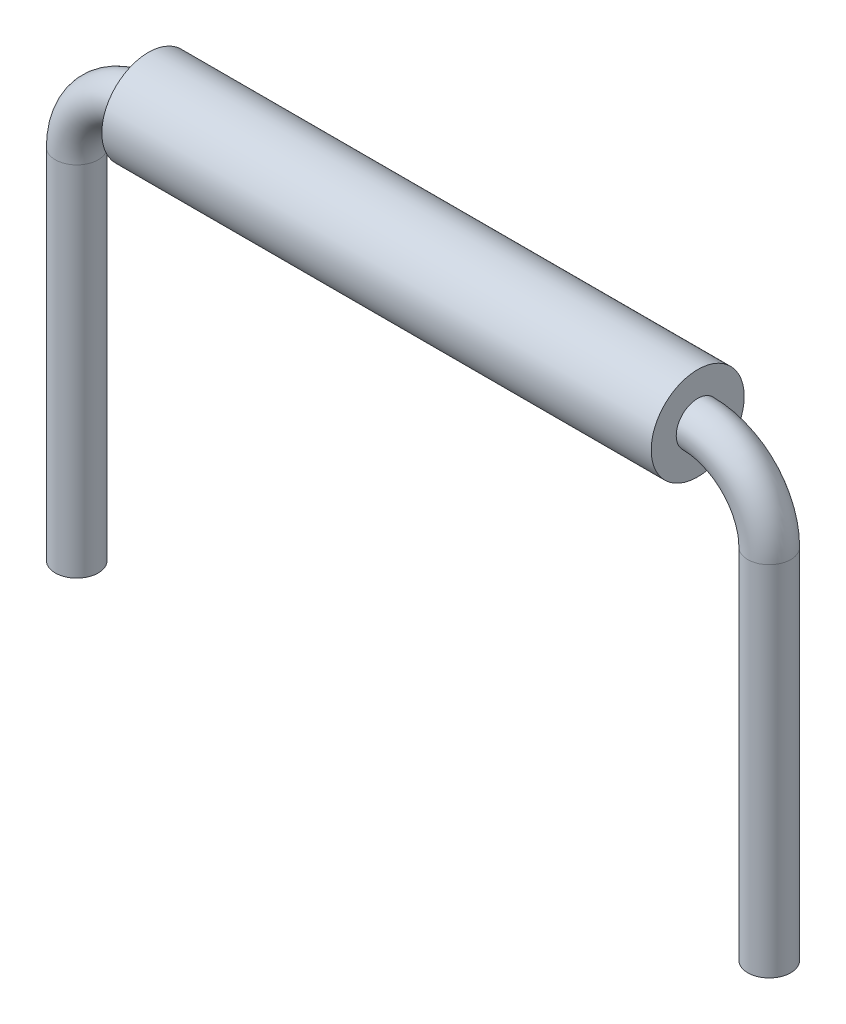
ISO-10303-21;
HEADER;
FILE_DESCRIPTION(('STEP AP214'),'2;1');
FILE_NAME('part.step','',(''),(''),'','','');
FILE_SCHEMA(('AUTOMOTIVE_DESIGN { 1 0 10303 214 1 1 1 1 }'));
ENDSEC;
DATA;
#1=APPLICATION_CONTEXT('core data for automotive mechanical design processes');
#2=APPLICATION_PROTOCOL_DEFINITION('international standard','automotive_design',2000,#1);
#3=PRODUCT_CONTEXT('',#1,'mechanical');
#4=PRODUCT('Part','Part','',(#3));
#5=PRODUCT_RELATED_PRODUCT_CATEGORY('part','',(#4));
#6=PRODUCT_DEFINITION_FORMATION('','',#4);
#7=PRODUCT_DEFINITION_CONTEXT('part definition',#1,'design');
#8=PRODUCT_DEFINITION('design','',#6,#7);
#9=PRODUCT_DEFINITION_SHAPE('','',#8);
#10=(LENGTH_UNIT() NAMED_UNIT(*) SI_UNIT(.MILLI.,.METRE.));
#11=(NAMED_UNIT(*) PLANE_ANGLE_UNIT() SI_UNIT($,.RADIAN.));
#12=(NAMED_UNIT(*) SI_UNIT($,.STERADIAN.) SOLID_ANGLE_UNIT());
#13=UNCERTAINTY_MEASURE_WITH_UNIT(LENGTH_MEASURE(1.E-05),#10,'distance_accuracy_value','');
#14=(GEOMETRIC_REPRESENTATION_CONTEXT(3) GLOBAL_UNCERTAINTY_ASSIGNED_CONTEXT((#13)) GLOBAL_UNIT_ASSIGNED_CONTEXT((#10,
#11,#12)) REPRESENTATION_CONTEXT('',''));
#15=CARTESIAN_POINT('',(0.,0.,0.));
#16=DIRECTION('',(0.,0.,1.));
#17=DIRECTION('',(1.,0.,0.));
#18=AXIS2_PLACEMENT_3D('',#15,#16,#17);
#19=CARTESIAN_POINT('',(3.8375,0.,0.));
#20=DIRECTION('',(1.,0.,0.));
#21=DIRECTION('',(0.,0.,-1.));
#22=AXIS2_PLACEMENT_3D('',#19,#20,#21);
#23=PLANE('',#22);
#24=CARTESIAN_POINT('',(3.8375,0.,0.));
#25=DIRECTION('',(1.,0.,0.));
#26=DIRECTION('',(0.,0.,-1.));
#27=AXIS2_PLACEMENT_3D('',#24,#25,#26);
#28=CIRCLE('',#27,0.65);
#29=CARTESIAN_POINT('',(3.8375,0.,-0.65));
#30=VERTEX_POINT('',#29);
#31=EDGE_CURVE('E11',#30,#30,#28,.T.);
#32=ORIENTED_EDGE('',*,*,#31,.T.);
#33=EDGE_LOOP('',(#32));
#34=FACE_BOUND('',#33,.T.);
#35=CARTESIAN_POINT('',(3.8375,0.,0.));
#36=DIRECTION('',(1.,0.,0.));
#37=DIRECTION('',(0.,0.,-1.));
#38=AXIS2_PLACEMENT_3D('',#35,#36,#37);
#39=CIRCLE('',#38,0.3);
#40=CARTESIAN_POINT('',(3.8375,0.,-0.3));
#41=VERTEX_POINT('',#40);
#42=EDGE_CURVE('E52',#41,#41,#39,.T.);
#43=ORIENTED_EDGE('',*,*,#42,.F.);
#44=EDGE_LOOP('',(#43));
#45=FACE_BOUND('',#44,.T.);
#46=ADVANCED_FACE('F45',(#34,#45),#23,.T.);
#47=CARTESIAN_POINT('',(3.8375,0.,0.));
#48=DIRECTION('',(-1.,0.,0.));
#49=DIRECTION('',(0.,0.,1.));
#50=AXIS2_PLACEMENT_3D('',#47,#48,#49);
#51=CYLINDRICAL_SURFACE('',#50,0.65);
#52=ORIENTED_EDGE('',*,*,#31,.F.);
#53=EDGE_LOOP('',(#52));
#54=FACE_BOUND('',#53,.T.);
#55=CARTESIAN_POINT('',(-3.8375,0.,0.));
#56=DIRECTION('',(1.,0.,0.));
#57=DIRECTION('',(0.,0.,-1.));
#58=AXIS2_PLACEMENT_3D('',#55,#56,#57);
#59=CIRCLE('',#58,0.65);
#60=CARTESIAN_POINT('',(-3.8375,0.,-0.65));
#61=VERTEX_POINT('',#60);
#62=EDGE_CURVE('E56',#61,#61,#59,.T.);
#63=ORIENTED_EDGE('',*,*,#62,.T.);
#64=EDGE_LOOP('',(#63));
#65=FACE_BOUND('',#64,.T.);
#66=ADVANCED_FACE('F47',(#54,#65),#51,.T.);
#67=CARTESIAN_POINT('',(3.8375,0.,0.));
#68=DIRECTION('',(-1.,0.,0.));
#69=DIRECTION('',(0.,0.,1.));
#70=AXIS2_PLACEMENT_3D('',#67,#68,#69);
#71=CYLINDRICAL_SURFACE('',#70,0.3);
#72=ORIENTED_EDGE('',*,*,#42,.T.);
#73=EDGE_LOOP('',(#72));
#74=FACE_BOUND('',#73,.T.);
#75=CARTESIAN_POINT('',(-3.8375,0.,0.));
#76=DIRECTION('',(1.,0.,0.));
#77=DIRECTION('',(0.,0.,-1.));
#78=AXIS2_PLACEMENT_3D('',#75,#76,#77);
#79=CIRCLE('',#78,0.3);
#80=CARTESIAN_POINT('',(-3.8375,0.,-0.3));
#81=VERTEX_POINT('',#80);
#82=EDGE_CURVE('E60',#81,#81,#79,.T.);
#83=ORIENTED_EDGE('',*,*,#82,.F.);
#84=EDGE_LOOP('',(#83));
#85=FACE_BOUND('',#84,.T.);
#86=ADVANCED_FACE('F69',(#74,#85),#71,.F.);
#87=CARTESIAN_POINT('',(-3.8375,0.,0.));
#88=DIRECTION('',(1.,0.,0.));
#89=DIRECTION('',(0.,0.,-1.));
#90=AXIS2_PLACEMENT_3D('',#87,#88,#89);
#91=PLANE('',#90);
#92=ORIENTED_EDGE('',*,*,#82,.T.);
#93=EDGE_LOOP('',(#92));
#94=FACE_BOUND('',#93,.T.);
#95=ORIENTED_EDGE('',*,*,#62,.F.);
#96=EDGE_LOOP('',(#95));
#97=FACE_BOUND('',#96,.T.);
#98=ADVANCED_FACE('F66',(#94,#97),#91,.F.);
#99=CLOSED_SHELL('',(#46,#66,#86,#98));
#100=MANIFOLD_SOLID_BREP('B2',#99);
#101=CARTESIAN_POINT('',(4.8375,-6.,0.));
#102=DIRECTION('',(0.,-1.,0.));
#103=DIRECTION('',(0.,0.,-1.));
#104=AXIS2_PLACEMENT_3D('',#101,#102,#103);
#105=PLANE('',#104);
#106=CARTESIAN_POINT('',(4.8375,-6.,0.));
#107=DIRECTION('',(0.,-1.,0.));
#108=DIRECTION('',(0.,0.,-1.));
#109=AXIS2_PLACEMENT_3D('',#106,#107,#108);
#110=CIRCLE('',#109,0.3);
#111=CARTESIAN_POINT('',(4.8375,-6.,-0.3));
#112=VERTEX_POINT('',#111);
#113=EDGE_CURVE('E129',#112,#112,#110,.T.);
#114=ORIENTED_EDGE('',*,*,#113,.T.);
#115=EDGE_LOOP('',(#114));
#116=FACE_BOUND('',#115,.T.);
#117=ADVANCED_FACE('F107',(#116),#105,.T.);
#118=CARTESIAN_POINT('',(-4.8375,-6.,0.));
#119=DIRECTION('',(0.,1.,0.));
#120=DIRECTION('',(0.,0.,-1.));
#121=AXIS2_PLACEMENT_3D('',#118,#119,#120);
#122=PLANE('',#121);
#123=CARTESIAN_POINT('',(-4.8375,-6.,0.));
#124=DIRECTION('',(0.,1.,0.));
#125=DIRECTION('',(0.,0.,-1.));
#126=AXIS2_PLACEMENT_3D('',#123,#124,#125);
#127=CIRCLE('',#126,0.3);
#128=CARTESIAN_POINT('',(-4.8375,-6.,-0.3));
#129=VERTEX_POINT('',#128);
#130=EDGE_CURVE('E44',#129,#129,#127,.T.);
#131=ORIENTED_EDGE('',*,*,#130,.F.);
#132=EDGE_LOOP('',(#131));
#133=FACE_BOUND('',#132,.T.);
#134=ADVANCED_FACE('F137',(#133),#122,.F.);
#135=CARTESIAN_POINT('',(4.8375,-6.,0.));
#136=DIRECTION('',(0.,1.,0.));
#137=DIRECTION('',(-1.,0.,0.));
#138=AXIS2_PLACEMENT_3D('',#135,#136,#137);
#139=CYLINDRICAL_SURFACE('',#138,0.3);
#140=CARTESIAN_POINT('',(4.8375,-0.999999999999999,0.));
#141=DIRECTION('',(0.,-1.,0.));
#142=DIRECTION('',(0.,0.,-1.));
#143=AXIS2_PLACEMENT_3D('',#140,#141,#142);
#144=CIRCLE('',#143,0.3);
#145=CARTESIAN_POINT('',(5.1375,-0.999999999999999,0.));
#146=VERTEX_POINT('',#145);
#147=EDGE_CURVE('E126',#146,#146,#144,.T.);
#148=ORIENTED_EDGE('',*,*,#147,.T.);
#149=EDGE_LOOP('',(#148));
#150=FACE_BOUND('',#149,.T.);
#151=ORIENTED_EDGE('',*,*,#113,.F.);
#152=EDGE_LOOP('',(#151));
#153=FACE_BOUND('',#152,.T.);
#154=ADVANCED_FACE('F134',(#150,#153),#139,.T.);
#155=CARTESIAN_POINT('',(3.8375,-0.999999999999999,0.));
#156=DIRECTION('',(0.,0.,1.));
#157=DIRECTION('',(1.,0.,0.));
#158=AXIS2_PLACEMENT_3D('',#155,#156,#157);
#159=TOROIDAL_SURFACE('',#158,0.999999999999998,0.3);
#160=CARTESIAN_POINT('',(3.8375,0.,0.));
#161=DIRECTION('',(1.,0.,0.));
#162=DIRECTION('',(0.,0.,-1.));
#163=AXIS2_PLACEMENT_3D('',#160,#161,#162);
#164=CIRCLE('',#163,0.3);
#165=CARTESIAN_POINT('',(3.8375,0.299999999999999,0.));
#166=VERTEX_POINT('',#165);
#167=EDGE_CURVE('E121',#166,#166,#164,.T.);
#168=CARTESIAN_POINT('',(3.8375,-0.999999999999999,0.));
#169=DIRECTION('',(0.,0.,1.));
#170=DIRECTION('',(1.,0.,0.));
#171=AXIS2_PLACEMENT_3D('',#168,#169,#170);
#172=CIRCLE('',#171,1.3);
#173=EDGE_CURVE('',#146,#166,#172,.T.);
#174=ORIENTED_EDGE('',*,*,#147,.F.);
#175=ORIENTED_EDGE('',*,*,#167,.T.);
#176=ORIENTED_EDGE('',*,*,#173,.T.);
#177=ORIENTED_EDGE('',*,*,#173,.F.);
#178=EDGE_LOOP('',(#174,#176,#175,#177));
#179=FACE_BOUND('',#178,.T.);
#180=ADVANCED_FACE('F136',(#179),#159,.T.);
#181=CARTESIAN_POINT('',(3.8375,0.,0.));
#182=DIRECTION('',(-1.,0.,0.));
#183=DIRECTION('',(0.,-1.,0.));
#184=AXIS2_PLACEMENT_3D('',#181,#182,#183);
#185=CYLINDRICAL_SURFACE('',#184,0.3);
#186=CARTESIAN_POINT('',(-3.8375,0.,0.));
#187=DIRECTION('',(1.,0.,0.));
#188=DIRECTION('',(0.,0.,-1.));
#189=AXIS2_PLACEMENT_3D('',#186,#187,#188);
#190=CIRCLE('',#189,0.3);
#191=CARTESIAN_POINT('',(-3.8375,0.299999999999999,0.));
#192=VERTEX_POINT('',#191);
#193=EDGE_CURVE('E117',#192,#192,#190,.T.);
#194=ORIENTED_EDGE('',*,*,#193,.T.);
#195=EDGE_LOOP('',(#194));
#196=FACE_BOUND('',#195,.T.);
#197=ORIENTED_EDGE('',*,*,#167,.F.);
#198=EDGE_LOOP('',(#197));
#199=FACE_BOUND('',#198,.T.);
#200=ADVANCED_FACE('F144',(#196,#199),#185,.T.);
#201=CARTESIAN_POINT('',(-3.8375,-1.,0.));
#202=DIRECTION('',(0.,0.,1.));
#203=DIRECTION('',(1.,0.,0.));
#204=AXIS2_PLACEMENT_3D('',#201,#202,#203);
#205=TOROIDAL_SURFACE('',#204,0.999999999999999,0.3);
#206=CARTESIAN_POINT('',(-4.8375,-1.,0.));
#207=DIRECTION('',(0.,1.,0.));
#208=DIRECTION('',(0.,0.,-1.));
#209=AXIS2_PLACEMENT_3D('',#206,#207,#208);
#210=CIRCLE('',#209,0.3);
#211=CARTESIAN_POINT('',(-5.1375,-1.,0.));
#212=VERTEX_POINT('',#211);
#213=EDGE_CURVE('E113',#212,#212,#210,.T.);
#214=CARTESIAN_POINT('',(-3.8375,-1.,0.));
#215=DIRECTION('',(0.,0.,1.));
#216=DIRECTION('',(1.,0.,0.));
#217=AXIS2_PLACEMENT_3D('',#214,#215,#216);
#218=CIRCLE('',#217,1.3);
#219=EDGE_CURVE('',#192,#212,#218,.T.);
#220=ORIENTED_EDGE('',*,*,#193,.F.);
#221=ORIENTED_EDGE('',*,*,#213,.T.);
#222=ORIENTED_EDGE('',*,*,#219,.T.);
#223=ORIENTED_EDGE('',*,*,#219,.F.);
#224=EDGE_LOOP('',(#220,#222,#221,#223));
#225=FACE_BOUND('',#224,.T.);
#226=ADVANCED_FACE('F150',(#225),#205,.T.);
#227=CARTESIAN_POINT('',(-4.8375,-1.,0.));
#228=DIRECTION('',(0.,-1.,0.));
#229=DIRECTION('',(0.,0.,-1.));
#230=AXIS2_PLACEMENT_3D('',#227,#228,#229);
#231=CYLINDRICAL_SURFACE('',#230,0.3);
#232=ORIENTED_EDGE('',*,*,#130,.T.);
#233=EDGE_LOOP('',(#232));
#234=FACE_BOUND('',#233,.T.);
#235=ORIENTED_EDGE('',*,*,#213,.F.);
#236=EDGE_LOOP('',(#235));
#237=FACE_BOUND('',#236,.T.);
#238=ADVANCED_FACE('F148',(#234,#237),#231,.T.);
#239=CLOSED_SHELL('',(#117,#134,#154,#180,#200,#226,#238));
#240=MANIFOLD_SOLID_BREP('B6',#239);
#241=ADVANCED_BREP_SHAPE_REPRESENTATION('',(#18,#100,#240),#14);
#242=SHAPE_DEFINITION_REPRESENTATION(#9,#241);
ENDSEC;
END-ISO-10303-21;
